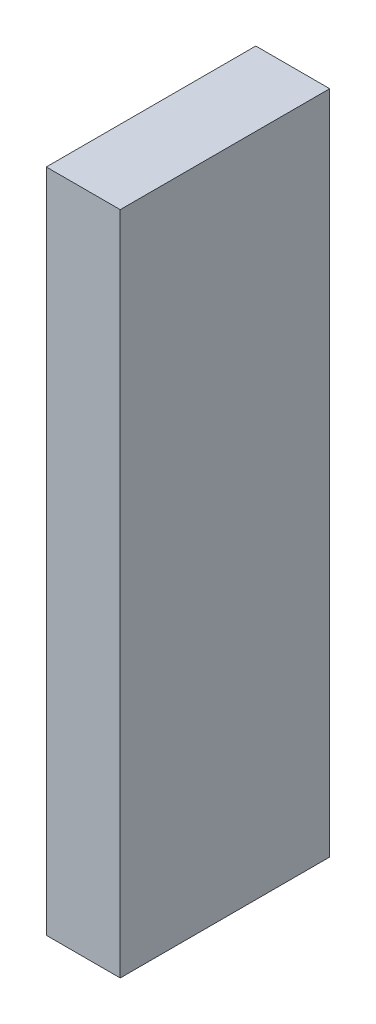
ISO-10303-21;
HEADER;
FILE_DESCRIPTION(('STEP AP214'),'2;1');
FILE_NAME('part.step','',(''),(''),'','','');
FILE_SCHEMA(('AUTOMOTIVE_DESIGN { 1 0 10303 214 1 1 1 1 }'));
ENDSEC;
DATA;
#1=APPLICATION_CONTEXT('core data for automotive mechanical design processes');
#2=APPLICATION_PROTOCOL_DEFINITION('international standard','automotive_design',2000,#1);
#3=PRODUCT_CONTEXT('',#1,'mechanical');
#4=PRODUCT('Part','Part','',(#3));
#5=PRODUCT_RELATED_PRODUCT_CATEGORY('part','',(#4));
#6=PRODUCT_DEFINITION_FORMATION('','',#4);
#7=PRODUCT_DEFINITION_CONTEXT('part definition',#1,'design');
#8=PRODUCT_DEFINITION('design','',#6,#7);
#9=PRODUCT_DEFINITION_SHAPE('','',#8);
#10=(LENGTH_UNIT() NAMED_UNIT(*) SI_UNIT(.MILLI.,.METRE.));
#11=(NAMED_UNIT(*) PLANE_ANGLE_UNIT() SI_UNIT($,.RADIAN.));
#12=(NAMED_UNIT(*) SI_UNIT($,.STERADIAN.) SOLID_ANGLE_UNIT());
#13=UNCERTAINTY_MEASURE_WITH_UNIT(LENGTH_MEASURE(1.E-05),#10,'distance_accuracy_value','');
#14=(GEOMETRIC_REPRESENTATION_CONTEXT(3) GLOBAL_UNCERTAINTY_ASSIGNED_CONTEXT((#13)) GLOBAL_UNIT_ASSIGNED_CONTEXT((#10,
#11,#12)) REPRESENTATION_CONTEXT('',''));
#15=CARTESIAN_POINT('',(0.,0.,0.));
#16=DIRECTION('',(0.,0.,1.));
#17=DIRECTION('',(1.,0.,0.));
#18=AXIS2_PLACEMENT_3D('',#15,#16,#17);
#19=CARTESIAN_POINT('',(2.44999827226896,2.70000039051402,0.));
#20=DIRECTION('',(-1.,8.74227765734759E-08,0.));
#21=DIRECTION('',(-8.74227765734759E-08,-1.,0.));
#22=AXIS2_PLACEMENT_3D('',#19,#20,#21);
#23=PLANE('',#22);
#24=DIRECTION('',(-8.74227765512293E-08,-0.999999999999996,0.));
#25=VECTOR('',#24,1.);
#26=CARTESIAN_POINT('',(2.44999827226896,2.70000039051402,0.));
#27=LINE('',#26,#25);
#28=CARTESIAN_POINT('',(2.44999827226896,2.70000039051402,0.));
#29=VERTEX_POINT('',#28);
#30=CARTESIAN_POINT('',(2.4499978001865,-2.69999350597035,0.));
#31=VERTEX_POINT('',#30);
#32=EDGE_CURVE('E11',#29,#31,#27,.T.);
#33=ORIENTED_EDGE('',*,*,#32,.T.);
#34=DIRECTION('',(0.,0.,1.));
#35=VECTOR('',#34,1.);
#36=CARTESIAN_POINT('',(2.4499978001865,-2.69999350597035,0.));
#37=LINE('',#36,#35);
#38=CARTESIAN_POINT('',(2.4499978001865,-2.69999350597035,1.6999990940094));
#39=VERTEX_POINT('',#38);
#40=EDGE_CURVE('E88',#31,#39,#37,.T.);
#41=ORIENTED_EDGE('',*,*,#40,.T.);
#42=DIRECTION('',(-8.74227765512293E-08,-0.999999999999996,0.));
#43=VECTOR('',#42,1.);
#44=CARTESIAN_POINT('',(2.44999827226896,2.70000039051402,1.6999990940094));
#45=LINE('',#44,#43);
#46=CARTESIAN_POINT('',(2.44999827226896,2.70000039051402,1.6999990940094));
#47=VERTEX_POINT('',#46);
#48=EDGE_CURVE('E83',#47,#39,#45,.T.);
#49=ORIENTED_EDGE('',*,*,#48,.F.);
#50=DIRECTION('',(0.,0.,1.));
#51=VECTOR('',#50,1.);
#52=CARTESIAN_POINT('',(2.44999827226896,2.70000039051401,0.));
#53=LINE('',#52,#51);
#54=EDGE_CURVE('E72',#29,#47,#53,.T.);
#55=ORIENTED_EDGE('',*,*,#54,.F.);
#56=EDGE_LOOP('',(#33,#41,#49,#55));
#57=FACE_BOUND('',#56,.T.);
#58=ADVANCED_FACE('F17',(#57),#23,.T.);
#59=CARTESIAN_POINT('',(2.4499978001865,-2.69999350597035,0.));
#60=DIRECTION('',(-8.74227765734759E-08,-1.,0.));
#61=DIRECTION('',(1.,-8.74227765734759E-08,0.));
#62=AXIS2_PLACEMENT_3D('',#59,#60,#61);
#63=PLANE('',#62);
#64=DIRECTION('',(0.999999999999996,-8.7422776708459E-08,0.));
#65=VECTOR('',#64,1.);
#66=CARTESIAN_POINT('',(2.4499978001865,-2.69999350597035,0.));
#67=LINE('',#66,#65);
#68=CARTESIAN_POINT('',(3.0499962743076,-2.6999935584239,0.));
#69=VERTEX_POINT('',#68);
#70=EDGE_CURVE('E24',#31,#69,#67,.T.);
#71=ORIENTED_EDGE('',*,*,#70,.T.);
#72=DIRECTION('',(0.,0.,1.));
#73=VECTOR('',#72,1.);
#74=CARTESIAN_POINT('',(3.0499962743076,-2.69999355842389,0.));
#75=LINE('',#74,#73);
#76=CARTESIAN_POINT('',(3.0499962743076,-2.6999935584239,1.6999990940094));
#77=VERTEX_POINT('',#76);
#78=EDGE_CURVE('E85',#69,#77,#75,.T.);
#79=ORIENTED_EDGE('',*,*,#78,.T.);
#80=DIRECTION('',(0.999999999999996,-8.7422776708459E-08,0.));
#81=VECTOR('',#80,1.);
#82=CARTESIAN_POINT('',(2.4499978001865,-2.69999350597035,1.6999990940094));
#83=LINE('',#82,#81);
#84=EDGE_CURVE('E66',#39,#77,#83,.T.);
#85=ORIENTED_EDGE('',*,*,#84,.F.);
#86=ORIENTED_EDGE('',*,*,#40,.F.);
#87=EDGE_LOOP('',(#71,#79,#85,#86));
#88=FACE_BOUND('',#87,.T.);
#89=ADVANCED_FACE('F89',(#88),#63,.T.);
#90=CARTESIAN_POINT('',(3.0499962743076,-2.6999935584239,0.));
#91=DIRECTION('',(1.,-8.74227765734759E-08,0.));
#92=DIRECTION('',(8.74227765734759E-08,1.,0.));
#93=AXIS2_PLACEMENT_3D('',#90,#91,#92);
#94=PLANE('',#93);
#95=DIRECTION('',(8.74227765512293E-08,0.999999999999996,0.));
#96=VECTOR('',#95,1.);
#97=CARTESIAN_POINT('',(3.0499962743076,-2.6999935584239,0.));
#98=LINE('',#97,#96);
#99=CARTESIAN_POINT('',(3.04999674639005,2.70000033806048,0.));
#100=VERTEX_POINT('',#99);
#101=EDGE_CURVE('E62',#69,#100,#98,.T.);
#102=ORIENTED_EDGE('',*,*,#101,.T.);
#103=DIRECTION('',(0.,0.,1.));
#104=VECTOR('',#103,1.);
#105=CARTESIAN_POINT('',(3.04999674639006,2.70000033806048,0.));
#106=LINE('',#105,#104);
#107=CARTESIAN_POINT('',(3.04999674639005,2.70000033806048,1.6999990940094));
#108=VERTEX_POINT('',#107);
#109=EDGE_CURVE('E55',#100,#108,#106,.T.);
#110=ORIENTED_EDGE('',*,*,#109,.T.);
#111=DIRECTION('',(8.74227765512293E-08,0.999999999999996,0.));
#112=VECTOR('',#111,1.);
#113=CARTESIAN_POINT('',(3.0499962743076,-2.6999935584239,1.6999990940094));
#114=LINE('',#113,#112);
#115=EDGE_CURVE('E59',#77,#108,#114,.T.);
#116=ORIENTED_EDGE('',*,*,#115,.F.);
#117=ORIENTED_EDGE('',*,*,#78,.F.);
#118=EDGE_LOOP('',(#102,#110,#116,#117));
#119=FACE_BOUND('',#118,.T.);
#120=ADVANCED_FACE('F57',(#119),#94,.T.);
#121=CARTESIAN_POINT('',(3.04999674639005,2.70000033806048,0.));
#122=DIRECTION('',(8.74227765734759E-08,1.,0.));
#123=DIRECTION('',(-1.,8.74227765734759E-08,0.));
#124=AXIS2_PLACEMENT_3D('',#121,#122,#123);
#125=PLANE('',#124);
#126=DIRECTION('',(-0.999999999999996,8.7422776708459E-08,0.));
#127=VECTOR('',#126,1.);
#128=CARTESIAN_POINT('',(3.04999674639005,2.70000033806048,0.));
#129=LINE('',#128,#127);
#130=EDGE_CURVE('E65',#100,#29,#129,.T.);
#131=ORIENTED_EDGE('',*,*,#130,.T.);
#132=ORIENTED_EDGE('',*,*,#54,.T.);
#133=DIRECTION('',(-0.999999999999996,8.7422776708459E-08,0.));
#134=VECTOR('',#133,1.);
#135=CARTESIAN_POINT('',(3.04999674639005,2.70000033806048,1.6999990940094));
#136=LINE('',#135,#134);
#137=EDGE_CURVE('E70',#108,#47,#136,.T.);
#138=ORIENTED_EDGE('',*,*,#137,.F.);
#139=ORIENTED_EDGE('',*,*,#109,.F.);
#140=EDGE_LOOP('',(#131,#132,#138,#139));
#141=FACE_BOUND('',#140,.T.);
#142=ADVANCED_FACE('F71',(#141),#125,.T.);
#143=CARTESIAN_POINT('',(41.8250045776367,74.8249969482422,1.6999990940094));
#144=DIRECTION('',(0.,0.,1.));
#145=DIRECTION('',(-1.,8.74227765734759E-08,0.));
#146=AXIS2_PLACEMENT_3D('',#143,#144,#145);
#147=PLANE('',#146);
#148=ORIENTED_EDGE('',*,*,#48,.T.);
#149=ORIENTED_EDGE('',*,*,#84,.T.);
#150=ORIENTED_EDGE('',*,*,#115,.T.);
#151=ORIENTED_EDGE('',*,*,#137,.T.);
#152=EDGE_LOOP('',(#148,#149,#150,#151));
#153=FACE_BOUND('',#152,.T.);
#154=ADVANCED_FACE('F76',(#153),#147,.T.);
#155=CARTESIAN_POINT('',(41.8250045776367,74.8249969482422,0.));
#156=DIRECTION('',(0.,0.,1.));
#157=DIRECTION('',(-1.,8.74227765734759E-08,0.));
#158=AXIS2_PLACEMENT_3D('',#155,#156,#157);
#159=PLANE('',#158);
#160=ORIENTED_EDGE('',*,*,#130,.F.);
#161=ORIENTED_EDGE('',*,*,#101,.F.);
#162=ORIENTED_EDGE('',*,*,#70,.F.);
#163=ORIENTED_EDGE('',*,*,#32,.F.);
#164=EDGE_LOOP('',(#160,#161,#162,#163));
#165=FACE_BOUND('',#164,.T.);
#166=ADVANCED_FACE('F91',(#165),#159,.F.);
#167=CLOSED_SHELL('',(#58,#89,#120,#142,#154,#166));
#168=MANIFOLD_SOLID_BREP('B1',#167);
#169=ADVANCED_BREP_SHAPE_REPRESENTATION('',(#18,#168),#14);
#170=SHAPE_DEFINITION_REPRESENTATION(#9,#169);
ENDSEC;
END-ISO-10303-21;
